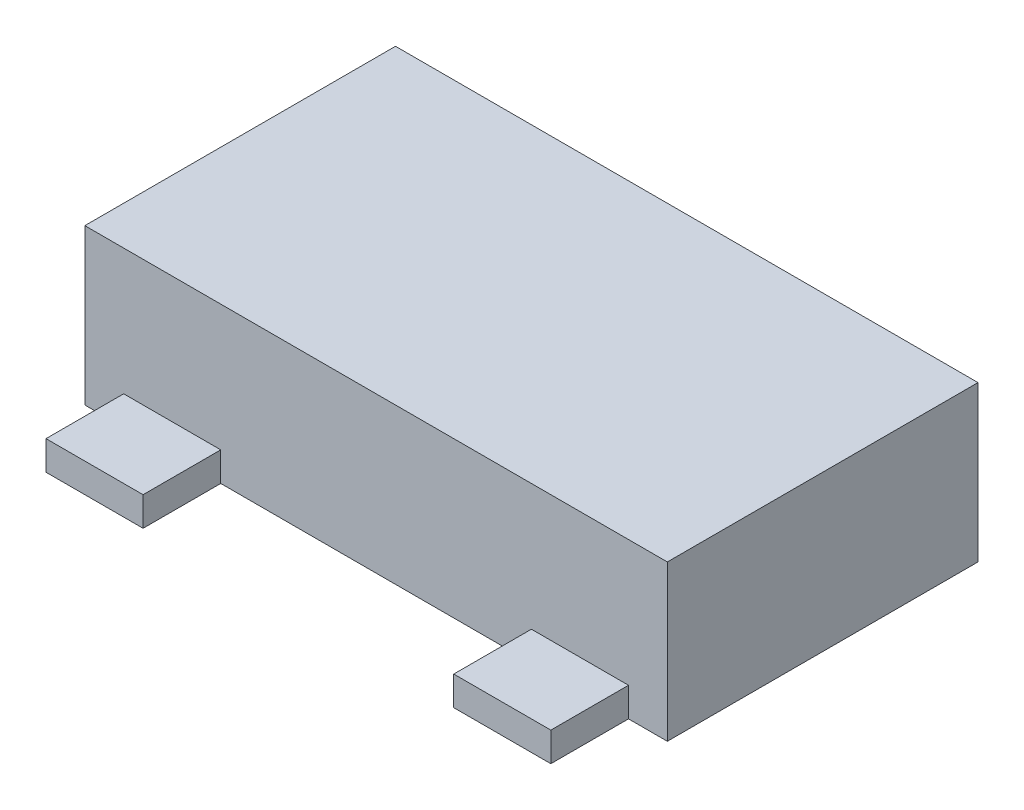
ISO-10303-21;
HEADER;
FILE_DESCRIPTION(('STEP AP214'),'2;1');
FILE_NAME('part.step','',(''),(''),'','','');
FILE_SCHEMA(('AUTOMOTIVE_DESIGN { 1 0 10303 214 1 1 1 1 }'));
ENDSEC;
DATA;
#1=APPLICATION_CONTEXT('core data for automotive mechanical design processes');
#2=APPLICATION_PROTOCOL_DEFINITION('international standard','automotive_design',2000,#1);
#3=PRODUCT_CONTEXT('',#1,'mechanical');
#4=PRODUCT('Part','Part','',(#3));
#5=PRODUCT_RELATED_PRODUCT_CATEGORY('part','',(#4));
#6=PRODUCT_DEFINITION_FORMATION('','',#4);
#7=PRODUCT_DEFINITION_CONTEXT('part definition',#1,'design');
#8=PRODUCT_DEFINITION('design','',#6,#7);
#9=PRODUCT_DEFINITION_SHAPE('','',#8);
#10=(LENGTH_UNIT() NAMED_UNIT(*) SI_UNIT(.MILLI.,.METRE.));
#11=(NAMED_UNIT(*) PLANE_ANGLE_UNIT() SI_UNIT($,.RADIAN.));
#12=(NAMED_UNIT(*) SI_UNIT($,.STERADIAN.) SOLID_ANGLE_UNIT());
#13=UNCERTAINTY_MEASURE_WITH_UNIT(LENGTH_MEASURE(1.E-05),#10,'distance_accuracy_value','');
#14=(GEOMETRIC_REPRESENTATION_CONTEXT(3) GLOBAL_UNCERTAINTY_ASSIGNED_CONTEXT((#13)) GLOBAL_UNIT_ASSIGNED_CONTEXT((#10,
#11,#12)) REPRESENTATION_CONTEXT('',''));
#15=CARTESIAN_POINT('',(0.,0.,0.));
#16=DIRECTION('',(0.,0.,1.));
#17=DIRECTION('',(1.,0.,0.));
#18=AXIS2_PLACEMENT_3D('',#15,#16,#17);
#19=CARTESIAN_POINT('',(-1.5,0.8,0.8));
#20=DIRECTION('',(0.,0.,-1.));
#21=DIRECTION('',(-1.,0.,0.));
#22=AXIS2_PLACEMENT_3D('',#19,#20,#21);
#23=PLANE('',#22);
#24=DIRECTION('',(-1.,0.,0.));
#25=VECTOR('',#24,1.);
#26=CARTESIAN_POINT('',(1.3,0.15,0.8));
#27=LINE('',#26,#25);
#28=CARTESIAN_POINT('',(1.3,0.15,0.8));
#29=VERTEX_POINT('',#28);
#30=CARTESIAN_POINT('',(0.8,0.15,0.8));
#31=VERTEX_POINT('',#30);
#32=EDGE_CURVE('E62',#29,#31,#27,.T.);
#33=ORIENTED_EDGE('',*,*,#32,.F.);
#34=DIRECTION('',(0.,-1.,0.));
#35=VECTOR('',#34,1.);
#36=CARTESIAN_POINT('',(1.3,0.790312423743285,0.8));
#37=LINE('',#36,#35);
#38=CARTESIAN_POINT('',(1.3,0.,0.8));
#39=VERTEX_POINT('',#38);
#40=EDGE_CURVE('E170',#29,#39,#37,.T.);
#41=ORIENTED_EDGE('',*,*,#40,.T.);
#42=DIRECTION('',(1.,0.,0.));
#43=VECTOR('',#42,1.);
#44=CARTESIAN_POINT('',(-1.5,0.,0.8));
#45=LINE('',#44,#43);
#46=CARTESIAN_POINT('',(1.5,0.,0.8));
#47=VERTEX_POINT('',#46);
#48=EDGE_CURVE('E155',#39,#47,#45,.T.);
#49=ORIENTED_EDGE('',*,*,#48,.T.);
#50=DIRECTION('',(0.,-1.,0.));
#51=VECTOR('',#50,1.);
#52=CARTESIAN_POINT('',(1.5,0.8,0.8));
#53=LINE('',#52,#51);
#54=CARTESIAN_POINT('',(1.5,0.8,0.8));
#55=VERTEX_POINT('',#54);
#56=EDGE_CURVE('E257',#55,#47,#53,.T.);
#57=ORIENTED_EDGE('',*,*,#56,.F.);
#58=DIRECTION('',(1.,0.,0.));
#59=VECTOR('',#58,1.);
#60=CARTESIAN_POINT('',(-1.5,0.8,0.8));
#61=LINE('',#60,#59);
#62=CARTESIAN_POINT('',(-1.5,0.8,0.8));
#63=VERTEX_POINT('',#62);
#64=EDGE_CURVE('E255',#63,#55,#61,.T.);
#65=ORIENTED_EDGE('',*,*,#64,.F.);
#66=DIRECTION('',(0.,-1.,0.));
#67=VECTOR('',#66,1.);
#68=CARTESIAN_POINT('',(-1.5,0.8,0.8));
#69=LINE('',#68,#67);
#70=CARTESIAN_POINT('',(-1.5,0.,0.8));
#71=VERTEX_POINT('',#70);
#72=EDGE_CURVE('E266',#63,#71,#69,.T.);
#73=ORIENTED_EDGE('',*,*,#72,.T.);
#74=CARTESIAN_POINT('',(-1.3,0.,0.8));
#75=VERTEX_POINT('',#74);
#76=EDGE_CURVE('E168',#71,#75,#45,.T.);
#77=ORIENTED_EDGE('',*,*,#76,.T.);
#78=DIRECTION('',(0.,-1.,0.));
#79=VECTOR('',#78,1.);
#80=CARTESIAN_POINT('',(-1.3,0.790312423743285,0.8));
#81=LINE('',#80,#79);
#82=CARTESIAN_POINT('',(-1.3,0.15,0.8));
#83=VERTEX_POINT('',#82);
#84=EDGE_CURVE('E213',#83,#75,#81,.T.);
#85=ORIENTED_EDGE('',*,*,#84,.F.);
#86=DIRECTION('',(1.,0.,0.));
#87=VECTOR('',#86,1.);
#88=CARTESIAN_POINT('',(-1.3,0.15,0.8));
#89=LINE('',#88,#87);
#90=CARTESIAN_POINT('',(-0.8,0.15,0.8));
#91=VERTEX_POINT('',#90);
#92=EDGE_CURVE('E199',#83,#91,#89,.T.);
#93=ORIENTED_EDGE('',*,*,#92,.T.);
#94=DIRECTION('',(0.,-1.,0.));
#95=VECTOR('',#94,1.);
#96=CARTESIAN_POINT('',(-0.8,0.790312423743285,0.8));
#97=LINE('',#96,#95);
#98=CARTESIAN_POINT('',(-0.8,0.,0.8));
#99=VERTEX_POINT('',#98);
#100=EDGE_CURVE('E215',#91,#99,#97,.T.);
#101=ORIENTED_EDGE('',*,*,#100,.T.);
#102=CARTESIAN_POINT('',(0.8,0.,0.8));
#103=VERTEX_POINT('',#102);
#104=EDGE_CURVE('E165',#99,#103,#45,.T.);
#105=ORIENTED_EDGE('',*,*,#104,.T.);
#106=DIRECTION('',(0.,-1.,0.));
#107=VECTOR('',#106,1.);
#108=CARTESIAN_POINT('',(0.8,0.790312423743285,0.8));
#109=LINE('',#108,#107);
#110=EDGE_CURVE('E58',#31,#103,#109,.T.);
#111=ORIENTED_EDGE('',*,*,#110,.F.);
#112=EDGE_LOOP('',(#33,#41,#49,#57,#65,#73,#77,#85,#93,#101,#105,#111));
#113=FACE_BOUND('',#112,.T.);
#114=ADVANCED_FACE('F43',(#113),#23,.F.);
#115=CARTESIAN_POINT('',(-1.5,0.8,-0.8));
#116=DIRECTION('',(0.,0.,1.));
#117=DIRECTION('',(1.,0.,0.));
#118=AXIS2_PLACEMENT_3D('',#115,#116,#117);
#119=PLANE('',#118);
#120=DIRECTION('',(0.,-1.,0.));
#121=VECTOR('',#120,1.);
#122=CARTESIAN_POINT('',(0.25,0.15,-0.8));
#123=LINE('',#122,#121);
#124=CARTESIAN_POINT('',(0.25,0.15,-0.8));
#125=VERTEX_POINT('',#124);
#126=CARTESIAN_POINT('',(0.25,0.,-0.8));
#127=VERTEX_POINT('',#126);
#128=EDGE_CURVE('E243',#125,#127,#123,.T.);
#129=ORIENTED_EDGE('',*,*,#128,.F.);
#130=DIRECTION('',(1.,0.,0.));
#131=VECTOR('',#130,1.);
#132=CARTESIAN_POINT('',(-0.25,0.15,-0.8));
#133=LINE('',#132,#131);
#134=CARTESIAN_POINT('',(-0.25,0.15,-0.8));
#135=VERTEX_POINT('',#134);
#136=EDGE_CURVE('E226',#135,#125,#133,.T.);
#137=ORIENTED_EDGE('',*,*,#136,.F.);
#138=DIRECTION('',(0.,-1.,0.));
#139=VECTOR('',#138,1.);
#140=CARTESIAN_POINT('',(-0.25,0.15,-0.8));
#141=LINE('',#140,#139);
#142=CARTESIAN_POINT('',(-0.25,0.,-0.8));
#143=VERTEX_POINT('',#142);
#144=EDGE_CURVE('E245',#135,#143,#141,.T.);
#145=ORIENTED_EDGE('',*,*,#144,.T.);
#146=DIRECTION('',(-1.,0.,0.));
#147=VECTOR('',#146,1.);
#148=CARTESIAN_POINT('',(-1.5,0.,-0.8));
#149=LINE('',#148,#147);
#150=CARTESIAN_POINT('',(-1.5,0.,-0.8));
#151=VERTEX_POINT('',#150);
#152=EDGE_CURVE('E259',#143,#151,#149,.T.);
#153=ORIENTED_EDGE('',*,*,#152,.T.);
#154=DIRECTION('',(0.,-1.,0.));
#155=VECTOR('',#154,1.);
#156=CARTESIAN_POINT('',(-1.5,0.8,-0.8));
#157=LINE('',#156,#155);
#158=CARTESIAN_POINT('',(-1.5,0.8,-0.8));
#159=VERTEX_POINT('',#158);
#160=EDGE_CURVE('E51',#159,#151,#157,.T.);
#161=ORIENTED_EDGE('',*,*,#160,.F.);
#162=DIRECTION('',(-1.,0.,0.));
#163=VECTOR('',#162,1.);
#164=CARTESIAN_POINT('',(-1.5,0.8,-0.8));
#165=LINE('',#164,#163);
#166=CARTESIAN_POINT('',(1.5,0.8,-0.8));
#167=VERTEX_POINT('',#166);
#168=EDGE_CURVE('E251',#167,#159,#165,.T.);
#169=ORIENTED_EDGE('',*,*,#168,.F.);
#170=DIRECTION('',(0.,-1.,0.));
#171=VECTOR('',#170,1.);
#172=CARTESIAN_POINT('',(1.5,0.8,-0.8));
#173=LINE('',#172,#171);
#174=CARTESIAN_POINT('',(1.5,0.,-0.8));
#175=VERTEX_POINT('',#174);
#176=EDGE_CURVE('E11',#167,#175,#173,.T.);
#177=ORIENTED_EDGE('',*,*,#176,.T.);
#178=EDGE_CURVE('E260',#175,#127,#149,.T.);
#179=ORIENTED_EDGE('',*,*,#178,.T.);
#180=EDGE_LOOP('',(#129,#137,#145,#153,#161,#169,#177,#179));
#181=FACE_BOUND('',#180,.T.);
#182=ADVANCED_FACE('F288',(#181),#119,.F.);
#183=CARTESIAN_POINT('',(1.5,0.8,-0.8));
#184=DIRECTION('',(-1.,0.,0.));
#185=DIRECTION('',(0.,0.,1.));
#186=AXIS2_PLACEMENT_3D('',#183,#184,#185);
#187=PLANE('',#186);
#188=DIRECTION('',(0.,0.,-1.));
#189=VECTOR('',#188,1.);
#190=CARTESIAN_POINT('',(1.5,0.,-0.8));
#191=LINE('',#190,#189);
#192=EDGE_CURVE('E162',#47,#175,#191,.T.);
#193=ORIENTED_EDGE('',*,*,#192,.T.);
#194=ORIENTED_EDGE('',*,*,#176,.F.);
#195=DIRECTION('',(0.,0.,-1.));
#196=VECTOR('',#195,1.);
#197=CARTESIAN_POINT('',(1.5,0.8,-0.8));
#198=LINE('',#197,#196);
#199=EDGE_CURVE('E248',#55,#167,#198,.T.);
#200=ORIENTED_EDGE('',*,*,#199,.F.);
#201=ORIENTED_EDGE('',*,*,#56,.T.);
#202=EDGE_LOOP('',(#193,#194,#200,#201));
#203=FACE_BOUND('',#202,.T.);
#204=ADVANCED_FACE('F45',(#203),#187,.F.);
#205=CARTESIAN_POINT('',(-1.5,0.8,-0.8));
#206=DIRECTION('',(1.,0.,0.));
#207=DIRECTION('',(0.,0.,-1.));
#208=AXIS2_PLACEMENT_3D('',#205,#206,#207);
#209=PLANE('',#208);
#210=DIRECTION('',(0.,0.,1.));
#211=VECTOR('',#210,1.);
#212=CARTESIAN_POINT('',(-1.5,0.,-0.8));
#213=LINE('',#212,#211);
#214=EDGE_CURVE('E166',#151,#71,#213,.T.);
#215=ORIENTED_EDGE('',*,*,#214,.T.);
#216=ORIENTED_EDGE('',*,*,#72,.F.);
#217=DIRECTION('',(0.,0.,1.));
#218=VECTOR('',#217,1.);
#219=CARTESIAN_POINT('',(-1.5,0.8,-0.8));
#220=LINE('',#219,#218);
#221=EDGE_CURVE('E253',#159,#63,#220,.T.);
#222=ORIENTED_EDGE('',*,*,#221,.F.);
#223=ORIENTED_EDGE('',*,*,#160,.T.);
#224=EDGE_LOOP('',(#215,#216,#222,#223));
#225=FACE_BOUND('',#224,.T.);
#226=ADVANCED_FACE('F273',(#225),#209,.F.);
#227=CARTESIAN_POINT('',(0.,0.8,0.));
#228=DIRECTION('',(0.,1.,0.));
#229=DIRECTION('',(0.,0.,1.));
#230=AXIS2_PLACEMENT_3D('',#227,#228,#229);
#231=PLANE('',#230);
#232=ORIENTED_EDGE('',*,*,#199,.T.);
#233=ORIENTED_EDGE('',*,*,#168,.T.);
#234=ORIENTED_EDGE('',*,*,#221,.T.);
#235=ORIENTED_EDGE('',*,*,#64,.T.);
#236=EDGE_LOOP('',(#232,#233,#234,#235));
#237=FACE_BOUND('',#236,.T.);
#238=ADVANCED_FACE('F285',(#237),#231,.T.);
#239=CARTESIAN_POINT('',(0.,0.,0.));
#240=DIRECTION('',(0.,1.,0.));
#241=DIRECTION('',(0.,0.,1.));
#242=AXIS2_PLACEMENT_3D('',#239,#240,#241);
#243=PLANE('',#242);
#244=ORIENTED_EDGE('',*,*,#192,.F.);
#245=ORIENTED_EDGE('',*,*,#48,.F.);
#246=DIRECTION('',(0.,0.,1.));
#247=VECTOR('',#246,1.);
#248=CARTESIAN_POINT('',(1.3,0.,0.8));
#249=LINE('',#248,#247);
#250=CARTESIAN_POINT('',(1.3,0.,1.2));
#251=VERTEX_POINT('',#250);
#252=EDGE_CURVE('E159',#39,#251,#249,.T.);
#253=ORIENTED_EDGE('',*,*,#252,.T.);
#254=DIRECTION('',(-1.,0.,0.));
#255=VECTOR('',#254,1.);
#256=CARTESIAN_POINT('',(1.3,0.,1.2));
#257=LINE('',#256,#255);
#258=CARTESIAN_POINT('',(0.8,0.,1.2));
#259=VERTEX_POINT('',#258);
#260=EDGE_CURVE('E181',#251,#259,#257,.T.);
#261=ORIENTED_EDGE('',*,*,#260,.T.);
#262=DIRECTION('',(0.,0.,-1.));
#263=VECTOR('',#262,1.);
#264=CARTESIAN_POINT('',(0.8,0.,0.8));
#265=LINE('',#264,#263);
#266=EDGE_CURVE('E178',#259,#103,#265,.T.);
#267=ORIENTED_EDGE('',*,*,#266,.T.);
#268=ORIENTED_EDGE('',*,*,#104,.F.);
#269=DIRECTION('',(0.,0.,-1.));
#270=VECTOR('',#269,1.);
#271=CARTESIAN_POINT('',(-0.8,0.,0.8));
#272=LINE('',#271,#270);
#273=CARTESIAN_POINT('',(-0.8,0.,1.2));
#274=VERTEX_POINT('',#273);
#275=EDGE_CURVE('E211',#274,#99,#272,.T.);
#276=ORIENTED_EDGE('',*,*,#275,.F.);
#277=DIRECTION('',(1.,0.,0.));
#278=VECTOR('',#277,1.);
#279=CARTESIAN_POINT('',(-1.3,0.,1.2));
#280=LINE('',#279,#278);
#281=CARTESIAN_POINT('',(-1.3,0.,1.2));
#282=VERTEX_POINT('',#281);
#283=EDGE_CURVE('E208',#282,#274,#280,.T.);
#284=ORIENTED_EDGE('',*,*,#283,.F.);
#285=DIRECTION('',(0.,0.,1.));
#286=VECTOR('',#285,1.);
#287=CARTESIAN_POINT('',(-1.3,0.,0.8));
#288=LINE('',#287,#286);
#289=EDGE_CURVE('E194',#75,#282,#288,.T.);
#290=ORIENTED_EDGE('',*,*,#289,.F.);
#291=ORIENTED_EDGE('',*,*,#76,.F.);
#292=ORIENTED_EDGE('',*,*,#214,.F.);
#293=ORIENTED_EDGE('',*,*,#152,.F.);
#294=DIRECTION('',(0.,0.,1.));
#295=VECTOR('',#294,1.);
#296=CARTESIAN_POINT('',(-0.25,0.,-0.8));
#297=LINE('',#296,#295);
#298=CARTESIAN_POINT('',(-0.25,0.,-1.2));
#299=VERTEX_POINT('',#298);
#300=EDGE_CURVE('E205',#299,#143,#297,.T.);
#301=ORIENTED_EDGE('',*,*,#300,.F.);
#302=DIRECTION('',(-1.,0.,0.));
#303=VECTOR('',#302,1.);
#304=CARTESIAN_POINT('',(-0.25,0.,-1.2));
#305=LINE('',#304,#303);
#306=CARTESIAN_POINT('',(0.25,0.,-1.2));
#307=VERTEX_POINT('',#306);
#308=EDGE_CURVE('E227',#307,#299,#305,.T.);
#309=ORIENTED_EDGE('',*,*,#308,.F.);
#310=DIRECTION('',(0.,0.,-1.));
#311=VECTOR('',#310,1.);
#312=CARTESIAN_POINT('',(0.25,0.,-0.8));
#313=LINE('',#312,#311);
#314=EDGE_CURVE('E235',#127,#307,#313,.T.);
#315=ORIENTED_EDGE('',*,*,#314,.F.);
#316=ORIENTED_EDGE('',*,*,#178,.F.);
#317=EDGE_LOOP('',(#244,#245,#253,#261,#267,#268,#276,#284,#290,#291,#292,#293,#301,#309,#315,#316));
#318=FACE_BOUND('',#317,.T.);
#319=ADVANCED_FACE('F156',(#318),#243,.F.);
#320=CARTESIAN_POINT('',(-0.25,0.15,-0.8));
#321=DIRECTION('',(1.,0.,0.));
#322=DIRECTION('',(0.,0.,-1.));
#323=AXIS2_PLACEMENT_3D('',#320,#321,#322);
#324=PLANE('',#323);
#325=ORIENTED_EDGE('',*,*,#300,.T.);
#326=ORIENTED_EDGE('',*,*,#144,.F.);
#327=DIRECTION('',(0.,0.,1.));
#328=VECTOR('',#327,1.);
#329=CARTESIAN_POINT('',(-0.25,0.15,-0.8));
#330=LINE('',#329,#328);
#331=CARTESIAN_POINT('',(-0.25,0.15,-1.2));
#332=VERTEX_POINT('',#331);
#333=EDGE_CURVE('E224',#332,#135,#330,.T.);
#334=ORIENTED_EDGE('',*,*,#333,.F.);
#335=DIRECTION('',(0.,-1.,0.));
#336=VECTOR('',#335,1.);
#337=CARTESIAN_POINT('',(-0.25,0.15,-1.2));
#338=LINE('',#337,#336);
#339=EDGE_CURVE('E233',#332,#299,#338,.T.);
#340=ORIENTED_EDGE('',*,*,#339,.T.);
#341=EDGE_LOOP('',(#325,#326,#334,#340));
#342=FACE_BOUND('',#341,.T.);
#343=ADVANCED_FACE('F303',(#342),#324,.F.);
#344=CARTESIAN_POINT('',(0.25,0.15,-0.8));
#345=DIRECTION('',(-1.,0.,0.));
#346=DIRECTION('',(0.,0.,1.));
#347=AXIS2_PLACEMENT_3D('',#344,#345,#346);
#348=PLANE('',#347);
#349=ORIENTED_EDGE('',*,*,#314,.T.);
#350=DIRECTION('',(0.,-1.,0.));
#351=VECTOR('',#350,1.);
#352=CARTESIAN_POINT('',(0.25,0.15,-1.2));
#353=LINE('',#352,#351);
#354=CARTESIAN_POINT('',(0.25,0.15,-1.2));
#355=VERTEX_POINT('',#354);
#356=EDGE_CURVE('E240',#355,#307,#353,.T.);
#357=ORIENTED_EDGE('',*,*,#356,.F.);
#358=DIRECTION('',(0.,0.,-1.));
#359=VECTOR('',#358,1.);
#360=CARTESIAN_POINT('',(0.25,0.15,-0.8));
#361=LINE('',#360,#359);
#362=EDGE_CURVE('E229',#125,#355,#361,.T.);
#363=ORIENTED_EDGE('',*,*,#362,.F.);
#364=ORIENTED_EDGE('',*,*,#128,.T.);
#365=EDGE_LOOP('',(#349,#357,#363,#364));
#366=FACE_BOUND('',#365,.T.);
#367=ADVANCED_FACE('F308',(#366),#348,.F.);
#368=CARTESIAN_POINT('',(-0.25,0.15,-1.2));
#369=DIRECTION('',(0.,0.,1.));
#370=DIRECTION('',(1.,0.,0.));
#371=AXIS2_PLACEMENT_3D('',#368,#369,#370);
#372=PLANE('',#371);
#373=ORIENTED_EDGE('',*,*,#308,.T.);
#374=ORIENTED_EDGE('',*,*,#339,.F.);
#375=DIRECTION('',(-1.,0.,0.));
#376=VECTOR('',#375,1.);
#377=CARTESIAN_POINT('',(-0.25,0.15,-1.2));
#378=LINE('',#377,#376);
#379=EDGE_CURVE('E231',#355,#332,#378,.T.);
#380=ORIENTED_EDGE('',*,*,#379,.F.);
#381=ORIENTED_EDGE('',*,*,#356,.T.);
#382=EDGE_LOOP('',(#373,#374,#380,#381));
#383=FACE_BOUND('',#382,.T.);
#384=ADVANCED_FACE('F312',(#383),#372,.F.);
#385=CARTESIAN_POINT('',(0.,0.15,0.));
#386=DIRECTION('',(0.,-1.,0.));
#387=DIRECTION('',(0.,0.,-1.));
#388=AXIS2_PLACEMENT_3D('',#385,#386,#387);
#389=PLANE('',#388);
#390=ORIENTED_EDGE('',*,*,#333,.T.);
#391=ORIENTED_EDGE('',*,*,#136,.T.);
#392=ORIENTED_EDGE('',*,*,#362,.T.);
#393=ORIENTED_EDGE('',*,*,#379,.T.);
#394=EDGE_LOOP('',(#390,#391,#392,#393));
#395=FACE_BOUND('',#394,.T.);
#396=ADVANCED_FACE('F316',(#395),#389,.F.);
#397=CARTESIAN_POINT('',(-0.8,0.790312423743285,0.8));
#398=DIRECTION('',(-1.,0.,0.));
#399=DIRECTION('',(0.,0.,1.));
#400=AXIS2_PLACEMENT_3D('',#397,#398,#399);
#401=PLANE('',#400);
#402=ORIENTED_EDGE('',*,*,#100,.F.);
#403=DIRECTION('',(0.,0.,1.));
#404=VECTOR('',#403,1.);
#405=CARTESIAN_POINT('',(-0.8,0.15,0.8));
#406=LINE('',#405,#404);
#407=CARTESIAN_POINT('',(-0.8,0.15,1.2));
#408=VERTEX_POINT('',#407);
#409=EDGE_CURVE('E195',#91,#408,#406,.T.);
#410=ORIENTED_EDGE('',*,*,#409,.T.);
#411=DIRECTION('',(0.,-1.,0.));
#412=VECTOR('',#411,1.);
#413=CARTESIAN_POINT('',(-0.8,0.790312423743285,1.2));
#414=LINE('',#413,#412);
#415=EDGE_CURVE('E218',#408,#274,#414,.T.);
#416=ORIENTED_EDGE('',*,*,#415,.T.);
#417=ORIENTED_EDGE('',*,*,#275,.T.);
#418=EDGE_LOOP('',(#402,#410,#416,#417));
#419=FACE_BOUND('',#418,.T.);
#420=ADVANCED_FACE('F320',(#419),#401,.F.);
#421=CARTESIAN_POINT('',(-1.3,0.790312423743285,1.2));
#422=DIRECTION('',(0.,0.,-1.));
#423=DIRECTION('',(-1.,0.,0.));
#424=AXIS2_PLACEMENT_3D('',#421,#422,#423);
#425=PLANE('',#424);
#426=ORIENTED_EDGE('',*,*,#415,.F.);
#427=DIRECTION('',(-1.,0.,0.));
#428=VECTOR('',#427,1.);
#429=CARTESIAN_POINT('',(-1.3,0.15,1.2));
#430=LINE('',#429,#428);
#431=CARTESIAN_POINT('',(-1.3,0.15,1.2));
#432=VERTEX_POINT('',#431);
#433=EDGE_CURVE('E198',#408,#432,#430,.T.);
#434=ORIENTED_EDGE('',*,*,#433,.T.);
#435=DIRECTION('',(0.,-1.,0.));
#436=VECTOR('',#435,1.);
#437=CARTESIAN_POINT('',(-1.3,0.790312423743285,1.2));
#438=LINE('',#437,#436);
#439=EDGE_CURVE('E220',#432,#282,#438,.T.);
#440=ORIENTED_EDGE('',*,*,#439,.T.);
#441=ORIENTED_EDGE('',*,*,#283,.T.);
#442=EDGE_LOOP('',(#426,#434,#440,#441));
#443=FACE_BOUND('',#442,.T.);
#444=ADVANCED_FACE('F326',(#443),#425,.F.);
#445=CARTESIAN_POINT('',(-1.3,0.790312423743285,0.8));
#446=DIRECTION('',(1.,0.,0.));
#447=DIRECTION('',(0.,0.,-1.));
#448=AXIS2_PLACEMENT_3D('',#445,#446,#447);
#449=PLANE('',#448);
#450=ORIENTED_EDGE('',*,*,#439,.F.);
#451=DIRECTION('',(0.,0.,-1.));
#452=VECTOR('',#451,1.);
#453=CARTESIAN_POINT('',(-1.3,0.15,0.8));
#454=LINE('',#453,#452);
#455=EDGE_CURVE('E202',#432,#83,#454,.T.);
#456=ORIENTED_EDGE('',*,*,#455,.T.);
#457=ORIENTED_EDGE('',*,*,#84,.T.);
#458=ORIENTED_EDGE('',*,*,#289,.T.);
#459=EDGE_LOOP('',(#450,#456,#457,#458));
#460=FACE_BOUND('',#459,.T.);
#461=ADVANCED_FACE('F322',(#460),#449,.F.);
#462=CARTESIAN_POINT('',(0.,0.15,0.));
#463=DIRECTION('',(0.,-1.,0.));
#464=DIRECTION('',(0.,0.,-1.));
#465=AXIS2_PLACEMENT_3D('',#462,#463,#464);
#466=PLANE('',#465);
#467=ORIENTED_EDGE('',*,*,#433,.F.);
#468=ORIENTED_EDGE('',*,*,#409,.F.);
#469=ORIENTED_EDGE('',*,*,#92,.F.);
#470=ORIENTED_EDGE('',*,*,#455,.F.);
#471=EDGE_LOOP('',(#467,#468,#469,#470));
#472=FACE_BOUND('',#471,.T.);
#473=ADVANCED_FACE('F325',(#472),#466,.F.);
#474=CARTESIAN_POINT('',(1.3,0.790312423743285,0.8));
#475=DIRECTION('',(1.,0.,0.));
#476=DIRECTION('',(0.,0.,-1.));
#477=AXIS2_PLACEMENT_3D('',#474,#475,#476);
#478=PLANE('',#477);
#479=DIRECTION('',(0.,0.,-1.));
#480=VECTOR('',#479,1.);
#481=CARTESIAN_POINT('',(1.3,0.15,0.8));
#482=LINE('',#481,#480);
#483=CARTESIAN_POINT('',(1.3,0.15,1.2));
#484=VERTEX_POINT('',#483);
#485=EDGE_CURVE('E184',#484,#29,#482,.T.);
#486=ORIENTED_EDGE('',*,*,#485,.F.);
#487=DIRECTION('',(0.,-1.,0.));
#488=VECTOR('',#487,1.);
#489=CARTESIAN_POINT('',(1.3,0.790312423743285,1.2));
#490=LINE('',#489,#488);
#491=EDGE_CURVE('E177',#484,#251,#490,.T.);
#492=ORIENTED_EDGE('',*,*,#491,.T.);
#493=ORIENTED_EDGE('',*,*,#252,.F.);
#494=ORIENTED_EDGE('',*,*,#40,.F.);
#495=EDGE_LOOP('',(#486,#492,#493,#494));
#496=FACE_BOUND('',#495,.T.);
#497=ADVANCED_FACE('F175',(#496),#478,.T.);
#498=CARTESIAN_POINT('',(0.8,0.790312423743285,0.8));
#499=DIRECTION('',(-1.,0.,0.));
#500=DIRECTION('',(0.,0.,1.));
#501=AXIS2_PLACEMENT_3D('',#498,#499,#500);
#502=PLANE('',#501);
#503=DIRECTION('',(0.,0.,1.));
#504=VECTOR('',#503,1.);
#505=CARTESIAN_POINT('',(0.8,0.15,0.8));
#506=LINE('',#505,#504);
#507=CARTESIAN_POINT('',(0.8,0.15,1.2));
#508=VERTEX_POINT('',#507);
#509=EDGE_CURVE('E173',#31,#508,#506,.T.);
#510=ORIENTED_EDGE('',*,*,#509,.F.);
#511=ORIENTED_EDGE('',*,*,#110,.T.);
#512=ORIENTED_EDGE('',*,*,#266,.F.);
#513=DIRECTION('',(0.,-1.,0.));
#514=VECTOR('',#513,1.);
#515=CARTESIAN_POINT('',(0.8,0.790312423743285,1.2));
#516=LINE('',#515,#514);
#517=EDGE_CURVE('E189',#508,#259,#516,.T.);
#518=ORIENTED_EDGE('',*,*,#517,.F.);
#519=EDGE_LOOP('',(#510,#511,#512,#518));
#520=FACE_BOUND('',#519,.T.);
#521=ADVANCED_FACE('F339',(#520),#502,.T.);
#522=CARTESIAN_POINT('',(1.3,0.790312423743285,1.2));
#523=DIRECTION('',(0.,0.,1.));
#524=DIRECTION('',(1.,0.,0.));
#525=AXIS2_PLACEMENT_3D('',#522,#523,#524);
#526=PLANE('',#525);
#527=DIRECTION('',(1.,0.,0.));
#528=VECTOR('',#527,1.);
#529=CARTESIAN_POINT('',(1.3,0.15,1.2));
#530=LINE('',#529,#528);
#531=EDGE_CURVE('E192',#508,#484,#530,.T.);
#532=ORIENTED_EDGE('',*,*,#531,.F.);
#533=ORIENTED_EDGE('',*,*,#517,.T.);
#534=ORIENTED_EDGE('',*,*,#260,.F.);
#535=ORIENTED_EDGE('',*,*,#491,.F.);
#536=EDGE_LOOP('',(#532,#533,#534,#535));
#537=FACE_BOUND('',#536,.T.);
#538=ADVANCED_FACE('F342',(#537),#526,.T.);
#539=CARTESIAN_POINT('',(0.,0.15,0.));
#540=DIRECTION('',(0.,-1.,0.));
#541=DIRECTION('',(0.,0.,-1.));
#542=AXIS2_PLACEMENT_3D('',#539,#540,#541);
#543=PLANE('',#542);
#544=ORIENTED_EDGE('',*,*,#485,.T.);
#545=ORIENTED_EDGE('',*,*,#32,.T.);
#546=ORIENTED_EDGE('',*,*,#509,.T.);
#547=ORIENTED_EDGE('',*,*,#531,.T.);
#548=EDGE_LOOP('',(#544,#545,#546,#547));
#549=FACE_BOUND('',#548,.T.);
#550=ADVANCED_FACE('F346',(#549),#543,.F.);
#551=CLOSED_SHELL('',(#114,#182,#204,#226,#238,#319,#343,#367,#384,#396,#420,#444,#461,#473,
#497,#521,#538,#550));
#552=MANIFOLD_SOLID_BREP('B2',#551);
#553=ADVANCED_BREP_SHAPE_REPRESENTATION('',(#18,#552),#14);
#554=SHAPE_DEFINITION_REPRESENTATION(#9,#553);
ENDSEC;
END-ISO-10303-21;
